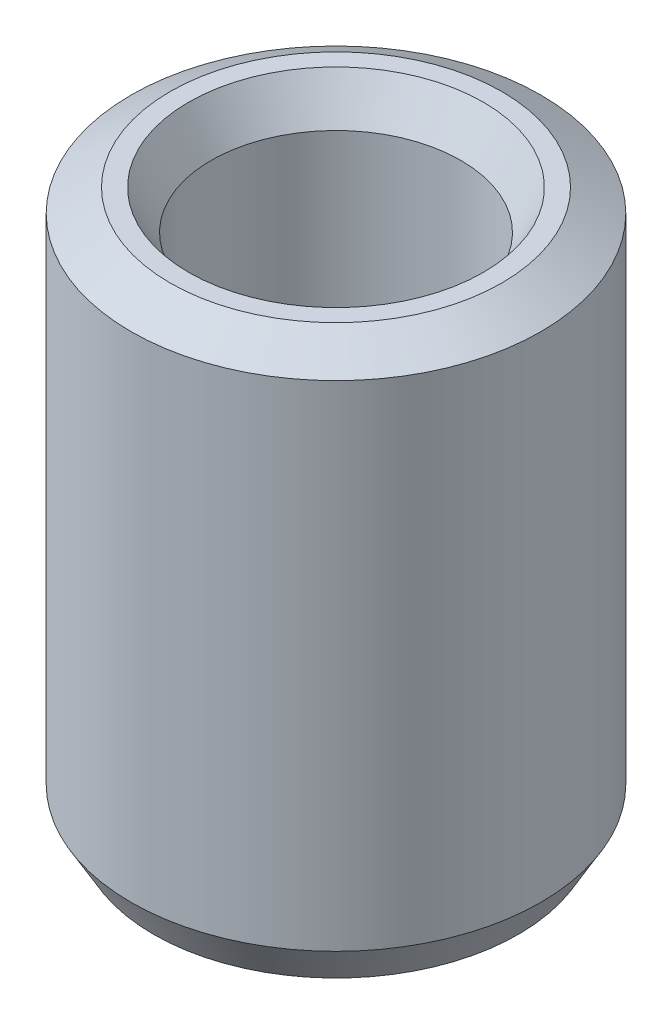
ISO-10303-21;
HEADER;
FILE_DESCRIPTION(('STEP AP214'),'2;1');
FILE_NAME('part.step','',(''),(''),'','','');
FILE_SCHEMA(('AUTOMOTIVE_DESIGN { 1 0 10303 214 1 1 1 1 }'));
ENDSEC;
DATA;
#1=APPLICATION_CONTEXT('core data for automotive mechanical design processes');
#2=APPLICATION_PROTOCOL_DEFINITION('international standard','automotive_design',2000,#1);
#3=PRODUCT_CONTEXT('',#1,'mechanical');
#4=PRODUCT('Part','Part','',(#3));
#5=PRODUCT_RELATED_PRODUCT_CATEGORY('part','',(#4));
#6=PRODUCT_DEFINITION_FORMATION('','',#4);
#7=PRODUCT_DEFINITION_CONTEXT('part definition',#1,'design');
#8=PRODUCT_DEFINITION('design','',#6,#7);
#9=PRODUCT_DEFINITION_SHAPE('','',#8);
#10=(LENGTH_UNIT() NAMED_UNIT(*) SI_UNIT(.MILLI.,.METRE.));
#11=(NAMED_UNIT(*) PLANE_ANGLE_UNIT() SI_UNIT($,.RADIAN.));
#12=(NAMED_UNIT(*) SI_UNIT($,.STERADIAN.) SOLID_ANGLE_UNIT());
#13=UNCERTAINTY_MEASURE_WITH_UNIT(LENGTH_MEASURE(1.E-05),#10,'distance_accuracy_value','');
#14=(GEOMETRIC_REPRESENTATION_CONTEXT(3) GLOBAL_UNCERTAINTY_ASSIGNED_CONTEXT((#13)) GLOBAL_UNIT_ASSIGNED_CONTEXT((#10,
#11,#12)) REPRESENTATION_CONTEXT('',''));
#15=CARTESIAN_POINT('',(0.,0.,0.));
#16=DIRECTION('',(0.,0.,1.));
#17=DIRECTION('',(1.,0.,0.));
#18=AXIS2_PLACEMENT_3D('',#15,#16,#17);
#19=CARTESIAN_POINT('',(0.,47.470158642553,0.));
#20=DIRECTION('',(0.,-1.,0.));
#21=DIRECTION('',(0.,0.,-1.));
#22=AXIS2_PLACEMENT_3D('',#19,#20,#21);
#23=CYLINDRICAL_SURFACE('',#22,17.5);
#24=CARTESIAN_POINT('',(0.,3.33787185914965,0.));
#25=DIRECTION('',(0.,1.,0.));
#26=DIRECTION('',(0.,0.,1.));
#27=AXIS2_PLACEMENT_3D('',#24,#25,#26);
#28=CIRCLE('',#27,17.5);
#29=CARTESIAN_POINT('',(0.,3.33787185914965,17.5));
#30=VERTEX_POINT('',#29);
#31=EDGE_CURVE('E10',#30,#30,#28,.T.);
#32=ORIENTED_EDGE('',*,*,#31,.T.);
#33=EDGE_LOOP('',(#32));
#34=FACE_BOUND('',#33,.T.);
#35=CARTESIAN_POINT('',(0.,45.5430374261524,0.));
#36=DIRECTION('',(0.,1.,0.));
#37=DIRECTION('',(0.,0.,1.));
#38=AXIS2_PLACEMENT_3D('',#35,#36,#37);
#39=CIRCLE('',#38,17.5);
#40=CARTESIAN_POINT('',(0.,45.5430374261524,17.5));
#41=VERTEX_POINT('',#40);
#42=EDGE_CURVE('E50',#41,#41,#39,.F.);
#43=ORIENTED_EDGE('',*,*,#42,.T.);
#44=EDGE_LOOP('',(#43));
#45=FACE_BOUND('',#44,.T.);
#46=ADVANCED_FACE('F39',(#34,#45),#23,.T.);
#47=CARTESIAN_POINT('',(0.,47.470158642553,0.));
#48=DIRECTION('',(0.,1.,0.));
#49=DIRECTION('',(0.,0.,1.));
#50=AXIS2_PLACEMENT_3D('',#47,#48,#49);
#51=PLANE('',#50);
#52=CARTESIAN_POINT('',(0.,47.470158642553,0.));
#53=DIRECTION('',(0.,1.,0.));
#54=DIRECTION('',(0.,0.,1.));
#55=AXIS2_PLACEMENT_3D('',#52,#53,#54);
#56=CIRCLE('',#55,12.586312466506);
#57=CARTESIAN_POINT('',(0.,47.470158642553,12.586312466506));
#58=VERTEX_POINT('',#57);
#59=EDGE_CURVE('E58',#58,#58,#56,.F.);
#60=ORIENTED_EDGE('',*,*,#59,.T.);
#61=EDGE_LOOP('',(#60));
#62=FACE_BOUND('',#61,.T.);
#63=CARTESIAN_POINT('',(0.,47.470158642553,0.));
#64=DIRECTION('',(0.,1.,0.));
#65=DIRECTION('',(0.,0.,1.));
#66=AXIS2_PLACEMENT_3D('',#63,#64,#65);
#67=CIRCLE('',#66,14.1621281408504);
#68=CARTESIAN_POINT('',(0.,47.470158642553,14.1621281408504));
#69=VERTEX_POINT('',#68);
#70=EDGE_CURVE('E61',#69,#69,#67,.T.);
#71=ORIENTED_EDGE('',*,*,#70,.T.);
#72=EDGE_LOOP('',(#71));
#73=FACE_BOUND('',#72,.T.);
#74=ADVANCED_FACE('F88',(#62,#73),#51,.T.);
#75=CARTESIAN_POINT('',(0.,0.,0.));
#76=DIRECTION('',(0.,1.,0.));
#77=DIRECTION('',(0.,0.,1.));
#78=AXIS2_PLACEMENT_3D('',#75,#76,#77);
#79=PLANE('',#78);
#80=CARTESIAN_POINT('',(0.,0.,0.));
#81=DIRECTION('',(0.,1.,0.));
#82=DIRECTION('',(0.,0.,1.));
#83=AXIS2_PLACEMENT_3D('',#80,#81,#82);
#84=CIRCLE('',#83,13.9970631092552);
#85=CARTESIAN_POINT('',(0.,0.,13.9970631092552));
#86=VERTEX_POINT('',#85);
#87=EDGE_CURVE('E51',#86,#86,#84,.T.);
#88=ORIENTED_EDGE('',*,*,#87,.T.);
#89=EDGE_LOOP('',(#88));
#90=FACE_BOUND('',#89,.T.);
#91=CARTESIAN_POINT('',(0.,0.,0.));
#92=DIRECTION('',(0.,1.,0.));
#93=DIRECTION('',(0.,0.,1.));
#94=AXIS2_PLACEMENT_3D('',#91,#92,#93);
#95=CIRCLE('',#94,15.5728787835995);
#96=CARTESIAN_POINT('',(0.,0.,15.5728787835995));
#97=VERTEX_POINT('',#96);
#98=EDGE_CURVE('E54',#97,#97,#95,.F.);
#99=ORIENTED_EDGE('',*,*,#98,.T.);
#100=EDGE_LOOP('',(#99));
#101=FACE_BOUND('',#100,.T.);
#102=ADVANCED_FACE('F83',(#90,#101),#79,.F.);
#103=CARTESIAN_POINT('',(0.,47.470158642553,0.));
#104=DIRECTION('',(0.,-1.,0.));
#105=DIRECTION('',(0.,0.,-1.));
#106=AXIS2_PLACEMENT_3D('',#103,#104,#105);
#107=CYLINDRICAL_SURFACE('',#106,10.6591912501055);
#108=CARTESIAN_POINT('',(0.,44.1322867834033,0.));
#109=DIRECTION('',(0.,1.,0.));
#110=DIRECTION('',(0.,0.,1.));
#111=AXIS2_PLACEMENT_3D('',#108,#109,#110);
#112=CIRCLE('',#111,10.6591912501055);
#113=CARTESIAN_POINT('',(0.,44.1322867834033,10.6591912501055));
#114=VERTEX_POINT('',#113);
#115=EDGE_CURVE('E67',#114,#114,#112,.T.);
#116=ORIENTED_EDGE('',*,*,#115,.T.);
#117=EDGE_LOOP('',(#116));
#118=FACE_BOUND('',#117,.T.);
#119=CARTESIAN_POINT('',(0.,1.92712121640055,0.));
#120=DIRECTION('',(0.,1.,0.));
#121=DIRECTION('',(0.,0.,1.));
#122=AXIS2_PLACEMENT_3D('',#119,#120,#121);
#123=CIRCLE('',#122,10.6591912501055);
#124=CARTESIAN_POINT('',(0.,1.92712121640055,10.6591912501055));
#125=VERTEX_POINT('',#124);
#126=EDGE_CURVE('E69',#125,#125,#123,.F.);
#127=ORIENTED_EDGE('',*,*,#126,.T.);
#128=EDGE_LOOP('',(#127));
#129=FACE_BOUND('',#128,.T.);
#130=ADVANCED_FACE('F71',(#118,#129),#107,.F.);
#131=CARTESIAN_POINT('',(0.,44.1322867834033,0.));
#132=DIRECTION('',(0.,1.,0.));
#133=DIRECTION('',(0.,0.,1.));
#134=AXIS2_PLACEMENT_3D('',#131,#132,#133);
#135=CONICAL_SURFACE('',#134,10.6591912501055,0.523598775598303);
#136=ORIENTED_EDGE('',*,*,#59,.F.);
#137=EDGE_LOOP('',(#136));
#138=FACE_BOUND('',#137,.T.);
#139=ORIENTED_EDGE('',*,*,#115,.F.);
#140=EDGE_LOOP('',(#139));
#141=FACE_BOUND('',#140,.T.);
#142=ADVANCED_FACE('F77',(#138,#141),#135,.F.);
#143=CARTESIAN_POINT('',(0.,0.,0.));
#144=DIRECTION('',(0.,-1.,0.));
#145=DIRECTION('',(0.,0.,-1.));
#146=AXIS2_PLACEMENT_3D('',#143,#144,#145);
#147=CONICAL_SURFACE('',#146,13.9970631092552,1.04719755119659);
#148=ORIENTED_EDGE('',*,*,#126,.F.);
#149=EDGE_LOOP('',(#148));
#150=FACE_BOUND('',#149,.T.);
#151=ORIENTED_EDGE('',*,*,#87,.F.);
#152=EDGE_LOOP('',(#151));
#153=FACE_BOUND('',#152,.T.);
#154=ADVANCED_FACE('F73',(#150,#153),#147,.F.);
#155=CARTESIAN_POINT('',(0.,3.33787185914965,0.));
#156=DIRECTION('',(0.,1.,0.));
#157=DIRECTION('',(0.,0.,1.));
#158=AXIS2_PLACEMENT_3D('',#155,#156,#157);
#159=CONICAL_SURFACE('',#158,17.5,0.523598775598303);
#160=ORIENTED_EDGE('',*,*,#98,.F.);
#161=EDGE_LOOP('',(#160));
#162=FACE_BOUND('',#161,.T.);
#163=ORIENTED_EDGE('',*,*,#31,.F.);
#164=EDGE_LOOP('',(#163));
#165=FACE_BOUND('',#164,.T.);
#166=ADVANCED_FACE('F76',(#162,#165),#159,.T.);
#167=CARTESIAN_POINT('',(0.,47.470158642553,0.));
#168=DIRECTION('',(0.,-1.,0.));
#169=DIRECTION('',(0.,0.,-1.));
#170=AXIS2_PLACEMENT_3D('',#167,#168,#169);
#171=CONICAL_SURFACE('',#170,14.1621281408504,1.04719755119659);
#172=ORIENTED_EDGE('',*,*,#42,.F.);
#173=EDGE_LOOP('',(#172));
#174=FACE_BOUND('',#173,.T.);
#175=ORIENTED_EDGE('',*,*,#70,.F.);
#176=EDGE_LOOP('',(#175));
#177=FACE_BOUND('',#176,.T.);
#178=ADVANCED_FACE('F45',(#174,#177),#171,.T.);
#179=CLOSED_SHELL('',(#46,#74,#102,#130,#142,#154,#166,#178));
#180=MANIFOLD_SOLID_BREP('B2',#179);
#181=ADVANCED_BREP_SHAPE_REPRESENTATION('',(#18,#180),#14);
#182=SHAPE_DEFINITION_REPRESENTATION(#9,#181);
ENDSEC;
END-ISO-10303-21;
